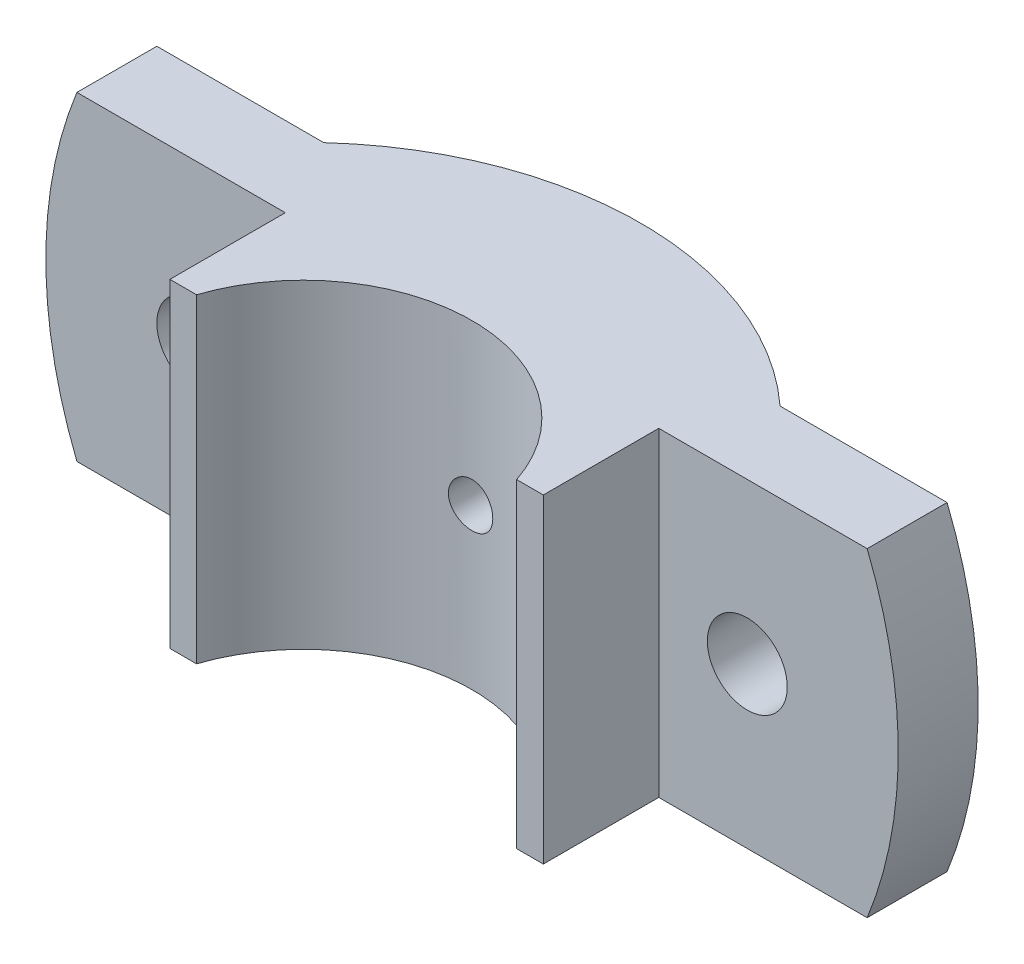
ISO-10303-21;
HEADER;
FILE_DESCRIPTION(('STEP AP214'),'2;1');
FILE_NAME('part.step','',(''),(''),'','','');
FILE_SCHEMA(('AUTOMOTIVE_DESIGN { 1 0 10303 214 1 1 1 1 }'));
ENDSEC;
DATA;
#1=APPLICATION_CONTEXT('core data for automotive mechanical design processes');
#2=APPLICATION_PROTOCOL_DEFINITION('international standard','automotive_design',2000,#1);
#3=PRODUCT_CONTEXT('',#1,'mechanical');
#4=PRODUCT('Part','Part','',(#3));
#5=PRODUCT_RELATED_PRODUCT_CATEGORY('part','',(#4));
#6=PRODUCT_DEFINITION_FORMATION('','',#4);
#7=PRODUCT_DEFINITION_CONTEXT('part definition',#1,'design');
#8=PRODUCT_DEFINITION('design','',#6,#7);
#9=PRODUCT_DEFINITION_SHAPE('','',#8);
#10=(LENGTH_UNIT() NAMED_UNIT(*) SI_UNIT(.MILLI.,.METRE.));
#11=(NAMED_UNIT(*) PLANE_ANGLE_UNIT() SI_UNIT($,.RADIAN.));
#12=(NAMED_UNIT(*) SI_UNIT($,.STERADIAN.) SOLID_ANGLE_UNIT());
#13=UNCERTAINTY_MEASURE_WITH_UNIT(LENGTH_MEASURE(1.E-05),#10,'distance_accuracy_value','');
#14=(GEOMETRIC_REPRESENTATION_CONTEXT(3) GLOBAL_UNCERTAINTY_ASSIGNED_CONTEXT((#13)) GLOBAL_UNIT_ASSIGNED_CONTEXT((#10,
#11,#12)) REPRESENTATION_CONTEXT('',''));
#15=CARTESIAN_POINT('',(0.,0.,0.));
#16=DIRECTION('',(0.,0.,1.));
#17=DIRECTION('',(1.,0.,0.));
#18=AXIS2_PLACEMENT_3D('',#15,#16,#17);
#19=CARTESIAN_POINT('',(-25.6904651573303,18.,-28.));
#20=DIRECTION('',(0.,0.,1.));
#21=DIRECTION('',(1.,0.,0.));
#22=AXIS2_PLACEMENT_3D('',#19,#20,#21);
#23=PLANE('',#22);
#24=CARTESIAN_POINT('',(0.,0.,-28.));
#25=DIRECTION('',(0.,0.,-1.));
#26=DIRECTION('',(1.,0.,0.));
#27=AXIS2_PLACEMENT_3D('',#24,#25,#26);
#28=CIRCLE('',#27,48.);
#29=CARTESIAN_POINT('',(-44.497190922574,-18.,-28.));
#30=VERTEX_POINT('',#29);
#31=CARTESIAN_POINT('',(-44.497190922574,18.,-28.));
#32=VERTEX_POINT('',#31);
#33=EDGE_CURVE('E428',#30,#32,#28,.T.);
#34=ORIENTED_EDGE('',*,*,#33,.T.);
#35=DIRECTION('',(-1.,0.,0.));
#36=VECTOR('',#35,1.);
#37=CARTESIAN_POINT('',(-25.6904651573303,18.,-28.));
#38=LINE('',#37,#36);
#39=CARTESIAN_POINT('',(-25.6904651573303,18.,-28.));
#40=VERTEX_POINT('',#39);
#41=EDGE_CURVE('E156',#40,#32,#38,.T.);
#42=ORIENTED_EDGE('',*,*,#41,.F.);
#43=DIRECTION('',(0.,-1.,0.));
#44=VECTOR('',#43,1.);
#45=CARTESIAN_POINT('',(-25.6904651573303,18.,-28.));
#46=LINE('',#45,#44);
#47=CARTESIAN_POINT('',(-25.6904651573303,6.63768331230678,-28.));
#48=VERTEX_POINT('',#47);
#49=EDGE_CURVE('E147',#40,#48,#46,.T.);
#50=ORIENTED_EDGE('',*,*,#49,.T.);
#51=CARTESIAN_POINT('',(-31.,0.,-28.));
#52=DIRECTION('',(0.,0.,1.));
#53=DIRECTION('',(-1.,0.,0.));
#54=AXIS2_PLACEMENT_3D('',#51,#52,#53);
#55=CIRCLE('',#54,8.5);
#56=CARTESIAN_POINT('',(-25.6904651573303,-6.63768331230678,-28.));
#57=VERTEX_POINT('',#56);
#58=EDGE_CURVE('E53',#57,#48,#55,.T.);
#59=ORIENTED_EDGE('',*,*,#58,.F.);
#60=CARTESIAN_POINT('',(-25.6904651573303,-18.,-28.));
#61=VERTEX_POINT('',#60);
#62=EDGE_CURVE('E150',#57,#61,#46,.T.);
#63=ORIENTED_EDGE('',*,*,#62,.T.);
#64=DIRECTION('',(-1.,0.,0.));
#65=VECTOR('',#64,1.);
#66=CARTESIAN_POINT('',(-25.6904651573303,-18.,-28.));
#67=LINE('',#66,#65);
#68=EDGE_CURVE('E476',#61,#30,#67,.T.);
#69=ORIENTED_EDGE('',*,*,#68,.T.);
#70=EDGE_LOOP('',(#34,#42,#50,#59,#63,#69));
#71=FACE_BOUND('',#70,.T.);
#72=CARTESIAN_POINT('',(-31.,0.,-28.));
#73=DIRECTION('',(0.,0.,1.));
#74=DIRECTION('',(1.,0.,0.));
#75=AXIS2_PLACEMENT_3D('',#72,#73,#74);
#76=CIRCLE('',#75,4.5);
#77=CARTESIAN_POINT('',(-26.5,0.,-28.));
#78=VERTEX_POINT('',#77);
#79=EDGE_CURVE('E141',#78,#78,#76,.T.);
#80=ORIENTED_EDGE('',*,*,#79,.T.);
#81=EDGE_LOOP('',(#80));
#82=FACE_BOUND('',#81,.T.);
#83=ADVANCED_FACE('F33',(#71,#82),#23,.F.);
#84=CARTESIAN_POINT('',(-50.,18.,-19.));
#85=DIRECTION('',(0.,0.,-1.));
#86=DIRECTION('',(-1.,0.,0.));
#87=AXIS2_PLACEMENT_3D('',#84,#85,#86);
#88=PLANE('',#87);
#89=CARTESIAN_POINT('',(0.,0.,-19.));
#90=DIRECTION('',(0.,0.,-1.));
#91=DIRECTION('',(-1.,0.,0.));
#92=AXIS2_PLACEMENT_3D('',#89,#90,#91);
#93=CIRCLE('',#92,48.);
#94=CARTESIAN_POINT('',(-44.497190922574,-18.,-19.));
#95=VERTEX_POINT('',#94);
#96=CARTESIAN_POINT('',(-44.497190922574,18.,-19.));
#97=VERTEX_POINT('',#96);
#98=EDGE_CURVE('E432',#95,#97,#93,.T.);
#99=ORIENTED_EDGE('',*,*,#98,.F.);
#100=DIRECTION('',(1.,0.,0.));
#101=VECTOR('',#100,1.);
#102=CARTESIAN_POINT('',(-50.,-18.,-19.));
#103=LINE('',#102,#101);
#104=CARTESIAN_POINT('',(-21.0277563773199,-18.,-19.));
#105=VERTEX_POINT('',#104);
#106=EDGE_CURVE('E479',#95,#105,#103,.T.);
#107=ORIENTED_EDGE('',*,*,#106,.T.);
#108=DIRECTION('',(0.,-1.,0.));
#109=VECTOR('',#108,1.);
#110=CARTESIAN_POINT('',(-21.0277563773199,18.,-19.));
#111=LINE('',#110,#109);
#112=CARTESIAN_POINT('',(-21.0277563773199,18.,-19.));
#113=VERTEX_POINT('',#112);
#114=EDGE_CURVE('E161',#113,#105,#111,.T.);
#115=ORIENTED_EDGE('',*,*,#114,.F.);
#116=DIRECTION('',(1.,0.,0.));
#117=VECTOR('',#116,1.);
#118=CARTESIAN_POINT('',(-50.,18.,-19.));
#119=LINE('',#118,#117);
#120=EDGE_CURVE('E455',#97,#113,#119,.T.);
#121=ORIENTED_EDGE('',*,*,#120,.F.);
#122=EDGE_LOOP('',(#99,#107,#115,#121));
#123=FACE_BOUND('',#122,.T.);
#124=CARTESIAN_POINT('',(-31.,0.,-19.));
#125=DIRECTION('',(0.,0.,-1.));
#126=DIRECTION('',(-1.,0.,0.));
#127=AXIS2_PLACEMENT_3D('',#124,#125,#126);
#128=CIRCLE('',#127,4.5);
#129=CARTESIAN_POINT('',(-35.5,0.,-19.));
#130=VERTEX_POINT('',#129);
#131=EDGE_CURVE('E180',#130,#130,#128,.F.);
#132=ORIENTED_EDGE('',*,*,#131,.F.);
#133=EDGE_LOOP('',(#132));
#134=FACE_BOUND('',#133,.T.);
#135=ADVANCED_FACE('F229',(#123,#134),#88,.F.);
#136=CARTESIAN_POINT('',(0.,18.,0.));
#137=DIRECTION('',(0.,-1.,0.));
#138=DIRECTION('',(0.,0.,-1.));
#139=AXIS2_PLACEMENT_3D('',#136,#137,#138);
#140=CYLINDRICAL_SURFACE('',#139,38.);
#141=CARTESIAN_POINT('',(-2.99999999999999,0.,-37.8813938497516));
#142=CARTESIAN_POINT('',(-2.99999263785231,-0.168229356223722,-37.881395424836));
#143=CARTESIAN_POINT('',(-2.98580184849921,-0.336574006245494,-37.8825265582867));
#144=CARTESIAN_POINT('',(-2.92939974932901,-0.668607649957892,-37.8869289647691));
#145=CARTESIAN_POINT('',(-2.88715648723706,-0.832291112499561,-37.8902026781767));
#146=CARTESIAN_POINT('',(-2.77587681608235,-1.1501452237575,-37.8985171541647));
#147=CARTESIAN_POINT('',(-2.70685535144457,-1.30432112294824,-37.9035569309858));
#148=CARTESIAN_POINT('',(-2.54400458445207,-1.59886160168987,-37.9148344391245));
#149=CARTESIAN_POINT('',(-2.45018067379415,-1.73922917388467,-37.92107191));
#150=CARTESIAN_POINT('',(-2.24015280345187,-2.00253137226757,-37.9340582512773));
#151=CARTESIAN_POINT('',(-2.1239032815472,-2.12542960763649,-37.9408081455451));
#152=CARTESIAN_POINT('',(-1.87242010716811,-2.34999209013841,-37.9540493837728));
#153=CARTESIAN_POINT('',(-1.7371856346283,-2.45165541954577,-37.9605407165486));
#154=CARTESIAN_POINT('',(-1.45135636719248,-2.63098168610704,-37.9725429812434));
#155=CARTESIAN_POINT('',(-1.3007419119018,-2.708613379424,-37.9780526329515));
#156=CARTESIAN_POINT('',(-0.988565369760012,-2.83747282349098,-37.9874597537665));
#157=CARTESIAN_POINT('',(-0.82700345710322,-2.88870099425837,-37.9913572485189));
#158=CARTESIAN_POINT('',(-0.497878390626905,-2.96319512715381,-37.9970937704964));
#159=CARTESIAN_POINT('',(-0.330328567016737,-2.98651964678537,-37.998937107936));
#160=CARTESIAN_POINT('',(0.00631733654750822,-3.0047253592679,-38.0003722094706));
#161=CARTESIAN_POINT('',(0.17541339034767,-2.99960703233397,-37.9999640115795));
#162=CARTESIAN_POINT('',(0.509954787192964,-2.96112032248106,-37.9969456003133));
#163=CARTESIAN_POINT('',(0.67540742527791,-2.92781491240174,-37.9943402955467));
#164=CARTESIAN_POINT('',(0.998366668593192,-2.83399732705022,-37.9872264182713));
#165=CARTESIAN_POINT('',(1.1558732048081,-2.77348491551835,-37.9827178292348));
#166=CARTESIAN_POINT('',(1.45867002090717,-2.62690060373558,-37.9722962502068));
#167=CARTESIAN_POINT('',(1.6039465541759,-2.54080042217035,-37.9663817077167));
#168=CARTESIAN_POINT('',(1.87800944429183,-2.34550517866702,-37.9538131184224));
#169=CARTESIAN_POINT('',(2.00679550141832,-2.23630969705861,-37.9471590581814));
#170=CARTESIAN_POINT('',(2.24458971981856,-1.99756841972296,-37.9338380622355));
#171=CARTESIAN_POINT('',(2.35354296660022,-1.86796791907116,-37.9271711409281));
#172=CARTESIAN_POINT('',(2.54815472752467,-1.59228636571935,-37.9145941321889));
#173=CARTESIAN_POINT('',(2.63381322519709,-1.44620530136698,-37.9086840452923));
#174=CARTESIAN_POINT('',(2.77940144234371,-1.14167162060739,-37.8982886351211));
#175=CARTESIAN_POINT('',(2.83932843779762,-0.98321769646658,-37.8938034627057));
#176=CARTESIAN_POINT('',(2.93171253141031,-0.658454052626347,-37.8867684945926));
#177=CARTESIAN_POINT('',(2.96417014717686,-0.492144481013882,-37.8842186624274));
#178=CARTESIAN_POINT('',(3.00062486955394,-0.15687062958801,-37.8813488492975));
#179=CARTESIAN_POINT('',(3.00469849779479,0.0120852808075245,-37.8810228729924));
#180=CARTESIAN_POINT('',(2.98446993701008,0.348277674479457,-37.8826218486592));
#181=CARTESIAN_POINT('',(2.96016798514648,0.515514172114851,-37.884546781818));
#182=CARTESIAN_POINT('',(2.88394184726827,0.843301603254927,-37.8904252096708));
#183=CARTESIAN_POINT('',(2.83205326228916,1.00386086655318,-37.8943760896121));
#184=CARTESIAN_POINT('',(2.70216294400362,1.31399395677734,-37.9038590548662));
#185=CARTESIAN_POINT('',(2.62416083401247,1.46356762519929,-37.9093911629878));
#186=CARTESIAN_POINT('',(2.44406357833825,1.74783416137562,-37.9214277776749));
#187=CARTESIAN_POINT('',(2.34191737427746,1.88249459296493,-37.9279343341079));
#188=CARTESIAN_POINT('',(2.11650535947003,2.13278456634996,-37.9411797159946));
#189=CARTESIAN_POINT('',(1.99323922217928,2.24841381384239,-37.9479185450382));
#190=CARTESIAN_POINT('',(1.72875604909499,2.45761968980163,-37.9608869464052));
#191=CARTESIAN_POINT('',(1.58749965829181,2.55114664697588,-37.9671153515116));
#192=CARTESIAN_POINT('',(1.29124223392212,2.71315246287969,-37.9783443227055));
#193=CARTESIAN_POINT('',(1.13624132557013,2.78163154976985,-37.9833448999771));
#194=CARTESIAN_POINT('',(0.817073838218853,2.8915121915042,-37.9915493740706));
#195=CARTESIAN_POINT('',(0.652917946506941,2.93294463032733,-37.9947553195452));
#196=CARTESIAN_POINT('',(0.319953232508929,2.98765683143964,-37.999017594232));
#197=CARTESIAN_POINT('',(0.151144488421416,3.00093706657949,-38.0000739595491));
#198=CARTESIAN_POINT('',(-0.185844007724723,2.99896261174756,-37.9999181203354));
#199=CARTESIAN_POINT('',(-0.354024222061248,2.98378540562109,-37.9987120758837));
#200=CARTESIAN_POINT('',(-0.685439460070171,2.92548825985853,-37.9941791393791));
#201=CARTESIAN_POINT('',(-0.848674476485683,2.88236827921959,-37.9908522442141));
#202=CARTESIAN_POINT('',(-1.16557212517757,2.76942883565186,-37.9824510315142));
#203=CARTESIAN_POINT('',(-1.3192351758783,2.69961054075428,-37.9773767904253));
#204=CARTESIAN_POINT('',(-1.61267080850137,2.53526551305572,-37.9660490429656));
#205=CARTESIAN_POINT('',(-1.7524436427022,2.44073922912224,-37.9597955580186));
#206=CARTESIAN_POINT('',(-2.01452730784427,2.22937105364119,-37.9467913112364));
#207=CARTESIAN_POINT('',(-2.13679197870458,2.11247200370349,-37.9400393035084));
#208=CARTESIAN_POINT('',(-2.3600119308789,1.85977604977668,-37.926809547746));
#209=CARTESIAN_POINT('',(-2.46096203215627,1.72397456524185,-37.9203318666858));
#210=CARTESIAN_POINT('',(-2.63880908526894,1.43709086811672,-37.9083720300883));
#211=CARTESIAN_POINT('',(-2.71566430398236,1.28598273615028,-37.9028916086487));
#212=CARTESIAN_POINT('',(-2.84281465262269,0.973068347368229,-37.8935681492736));
#213=CARTESIAN_POINT('',(-2.89314045280836,0.811274688620423,-37.8897232215665));
#214=CARTESIAN_POINT('',(-2.9529242107747,0.540431663186952,-37.8850993601198));
#215=CARTESIAN_POINT('',(-2.97055431578336,0.433126408915519,-37.883716139462));
#216=CARTESIAN_POINT('',(-2.99409457369404,0.217230128113448,-37.8818628767795));
#217=CARTESIAN_POINT('',(-3.00000475432558,0.108639104625571,-37.8813928325941));
#218=CARTESIAN_POINT('',(-2.99999999999999,0.,-37.8813938497516));
#219=B_SPLINE_CURVE_WITH_KNOTS('',3,(#141,#142,#143,#144,#145,#146,#147,#148,#149,#150,#151,
#152,#153,#154,#155,#156,#157,#158,#159,#160,#161,#162,#163,#164,#165,#166,#167,#168,#169,#170,
#171,#172,#173,#174,#175,#176,#177,#178,#179,#180,#181,#182,#183,#184,#185,#186,#187,#188,#189,
#190,#191,#192,#193,#194,#195,#196,#197,#198,#199,#200,#201,#202,#203,#204,#205,#206,#207,#208,
#209,#210,#211,#212,#213,#214,#215,#216,#217,#218),.UNSPECIFIED.,.T.,.F.,(4,2,2,2,2,2,2,2,2,2,2,
2,2,2,2,2,2,2,2,2,2,2,2,2,2,2,2,2,2,2,2,2,2,2,2,2,2,2,4),(0.,0.504291421669989,1.00915822788302,
1.51374368152856,2.01821953559138,2.52373134073237,3.02926498845646,3.53545315301367,
4.04163326507021,4.546749253583,5.05185671399058,5.55583868228782,6.05982502713927,
6.56437049631086,7.06892513448829,7.5748562462125,8.08078771565083,8.58677273143866,
9.09274821269729,9.59735908295554,10.1019657357268,10.6059227598395,11.10988705379,
11.6149267875576,12.1199743306602,12.6261463157288,13.1323136899712,13.6379020669613,
14.1434819519092,14.6476872439429,15.1518932758423,15.6560772516295,16.1602520685946,
16.6657325841807,17.1713358046312,17.6778099691558,18.1836973153047,18.5093592531183,
18.8350204204102),.UNSPECIFIED.);
#220=CARTESIAN_POINT('',(-2.99999999999999,0.,-37.8813938497516));
#221=VERTEX_POINT('',#220);
#222=EDGE_CURVE('E11',#221,#221,#219,.T.);
#223=ORIENTED_EDGE('',*,*,#222,.T.);
#224=EDGE_LOOP('',(#223));
#225=FACE_BOUND('',#224,.T.);
#226=ORIENTED_EDGE('',*,*,#62,.F.);
#227=CARTESIAN_POINT('',(-25.6904651573303,-6.63768331230679,-28.));
#228=CARTESIAN_POINT('',(-25.5360851043424,-6.51420867249736,-28.1416681018721));
#229=CARTESIAN_POINT('',(-25.3836215551735,-6.38340380017067,-28.2791823336498));
#230=CARTESIAN_POINT('',(-25.0841053598261,-6.1068595072457,-28.5451833866574));
#231=CARTESIAN_POINT('',(-24.9370580895264,-5.96110576476093,-28.6736613482156));
#232=CARTESIAN_POINT('',(-24.6491941230388,-5.653491442262,-28.9215085426633));
#233=CARTESIAN_POINT('',(-24.508431723833,-5.49151942353939,-29.0408031542341));
#234=CARTESIAN_POINT('',(-24.2363075607749,-5.15263687836669,-29.2682904084011));
#235=CARTESIAN_POINT('',(-24.1049430857226,-4.97573069263071,-29.3764862568107));
#236=CARTESIAN_POINT('',(-23.8528205053459,-4.60631493821572,-29.5815743674557));
#237=CARTESIAN_POINT('',(-23.7321338833277,-4.41371469093334,-29.6783916917415));
#238=CARTESIAN_POINT('',(-23.5043908446779,-4.01479632179465,-29.85908164754));
#239=CARTESIAN_POINT('',(-23.3973358972541,-3.8084767249227,-29.942952883943));
#240=CARTESIAN_POINT('',(-23.1992536300817,-3.38422419101504,-30.0966827286364));
#241=CARTESIAN_POINT('',(-23.1081729651955,-3.1663331999127,-30.1665880882949));
#242=CARTESIAN_POINT('',(-22.9434688496595,-2.72008092153074,-30.2920447623401));
#243=CARTESIAN_POINT('',(-22.869842066784,-2.49172164276593,-30.347598816803));
#244=CARTESIAN_POINT('',(-22.7499342032063,-2.05682098381956,-30.4375648556656));
#245=CARTESIAN_POINT('',(-22.7013462567531,-1.85128534823191,-30.4737833576563));
#246=CARTESIAN_POINT('',(-22.6194172898017,-1.43551725204115,-30.534645499234));
#247=CARTESIAN_POINT('',(-22.5860747992536,-1.2252852463389,-30.5592902548309));
#248=CARTESIAN_POINT('',(-22.5352129551669,-0.801799591498527,-30.5968164834569));
#249=CARTESIAN_POINT('',(-22.5176992505084,-0.588544891193922,-30.6096937569973));
#250=CARTESIAN_POINT('',(-22.4988301660851,-0.160939560666236,-30.6235658271181));
#251=CARTESIAN_POINT('',(-22.4974739036633,0.0534110090511308,-30.624561272785));
#252=CARTESIAN_POINT('',(-22.5103301119086,0.461997479818146,-30.6151119876343));
#253=CARTESIAN_POINT('',(-22.5231488228924,0.656303160135772,-30.6056914251709));
#254=CARTESIAN_POINT('',(-22.5619809221014,1.04286259298841,-30.5770763766543));
#255=CARTESIAN_POINT('',(-22.5879939672906,1.23511639873688,-30.5578821447042));
#256=CARTESIAN_POINT('',(-22.6528192304938,1.61613906729809,-30.5098574663833));
#257=CARTESIAN_POINT('',(-22.6916259266854,1.80490939654948,-30.4810311771979));
#258=CARTESIAN_POINT('',(-22.7814851533843,2.17779604427594,-30.4139289484325));
#259=CARTESIAN_POINT('',(-22.8325379785097,2.36191225066403,-30.3756527815061));
#260=CARTESIAN_POINT('',(-22.9463727274414,2.72495933677603,-30.2897519777021));
#261=CARTESIAN_POINT('',(-23.0091940590921,2.90387039063447,-30.2420959034169));
#262=CARTESIAN_POINT('',(-23.1456283742011,3.2548914886335,-30.1378044455698));
#263=CARTESIAN_POINT('',(-23.2192449894415,3.4269992191435,-30.0811660396201));
#264=CARTESIAN_POINT('',(-23.3763137314078,3.76349373210636,-29.9592695660632));
#265=CARTESIAN_POINT('',(-23.4597660818508,3.92788033882066,-29.8940113023904));
#266=CARTESIAN_POINT('',(-23.635527045378,4.24828704232643,-29.7552415450916));
#267=CARTESIAN_POINT('',(-23.7278387953854,4.40430414494655,-29.6817271265587));
#268=CARTESIAN_POINT('',(-23.9282386479047,4.71995510834892,-29.5204551498757));
#269=CARTESIAN_POINT('',(-24.0370002176616,4.87881602386906,-29.432022004933));
#270=CARTESIAN_POINT('',(-24.2623844714665,5.1856332961988,-29.2465042091278));
#271=CARTESIAN_POINT('',(-24.379010630913,5.33358477081362,-29.1494157272481));
#272=CARTESIAN_POINT('',(-24.6187042069683,5.61815393006346,-28.9472618083659));
#273=CARTESIAN_POINT('',(-24.7417672458198,5.75477915839727,-28.8422017715012));
#274=CARTESIAN_POINT('',(-24.9931857635632,6.016738259449,-28.6246099475779));
#275=CARTESIAN_POINT('',(-25.121541230047,6.14207215863705,-28.5120781780363));
#276=CARTESIAN_POINT('',(-25.3239635142993,6.32788833390874,-28.3320696328102));
#277=CARTESIAN_POINT('',(-25.3966039536003,6.39227987552885,-28.2669811541268));
#278=CARTESIAN_POINT('',(-25.5428336292653,6.51755974656749,-28.1349133065772));
#279=CARTESIAN_POINT('',(-25.6164208573993,6.57845434819234,-28.0679376662269));
#280=CARTESIAN_POINT('',(-25.6904651573302,6.63768331230704,-28.0000000000002));
#281=B_SPLINE_CURVE_WITH_KNOTS('',3,(#227,#228,#229,#230,#231,#232,#233,#234,#235,#236,#237,
#238,#239,#240,#241,#242,#243,#244,#245,#246,#247,#248,#249,#250,#251,#252,#253,#254,#255,#256,
#257,#258,#259,#260,#261,#262,#263,#264,#265,#266,#267,#268,#269,#270,#271,#272,#273,#274,#275,
#276,#277,#278,#279,#280),.UNSPECIFIED.,.F.,.F.,(4,2,2,2,2,2,2,2,2,2,2,2,2,2,2,2,2,2,2,2,2,2,2,
2,2,2,4),(0.,0.729592400834075,1.45989044138352,2.19560470883999,2.93110586753775,
3.67120763552798,4.41138910352643,5.14904966030397,5.8865692722368,6.52855006409985,
7.17046893961489,7.8126168088522,8.45472959834446,9.03890309081732,9.62306139629814,
10.2069679046447,10.7908884620571,11.3768004587137,11.9629100238154,12.549032922753,
13.1353641263273,13.7703169673958,14.4055522594533,15.040361004022,15.6751682603777,
16.0257258218313,16.3756336015193),.UNSPECIFIED.);
#282=EDGE_CURVE('E46',#57,#48,#281,.T.);
#283=ORIENTED_EDGE('',*,*,#282,.T.);
#284=ORIENTED_EDGE('',*,*,#49,.F.);
#285=CARTESIAN_POINT('',(0.,18.,0.));
#286=DIRECTION('',(0.,1.,0.));
#287=DIRECTION('',(0.,0.,1.));
#288=AXIS2_PLACEMENT_3D('',#285,#286,#287);
#289=CIRCLE('',#288,38.);
#290=CARTESIAN_POINT('',(25.6904651573303,18.,-28.));
#291=VERTEX_POINT('',#290);
#292=EDGE_CURVE('E452',#291,#40,#289,.T.);
#293=ORIENTED_EDGE('',*,*,#292,.F.);
#294=DIRECTION('',(0.,-1.,0.));
#295=VECTOR('',#294,1.);
#296=CARTESIAN_POINT('',(25.6904651573303,18.,-28.));
#297=LINE('',#296,#295);
#298=CARTESIAN_POINT('',(25.6904651573303,6.63768331230678,-28.));
#299=VERTEX_POINT('',#298);
#300=EDGE_CURVE('E159',#291,#299,#297,.T.);
#301=ORIENTED_EDGE('',*,*,#300,.T.);
#302=CARTESIAN_POINT('',(25.6904651573303,-6.63768331230679,-28.));
#303=CARTESIAN_POINT('',(25.5360851043424,-6.51420867249736,-28.1416681018721));
#304=CARTESIAN_POINT('',(25.3836215551735,-6.38340380017067,-28.2791823336498));
#305=CARTESIAN_POINT('',(25.0841053598261,-6.1068595072457,-28.5451833866574));
#306=CARTESIAN_POINT('',(24.9370580895264,-5.96110576476093,-28.6736613482156));
#307=CARTESIAN_POINT('',(24.6491941230388,-5.653491442262,-28.9215085426633));
#308=CARTESIAN_POINT('',(24.508431723833,-5.49151942353939,-29.0408031542341));
#309=CARTESIAN_POINT('',(24.2363075607749,-5.15263687836669,-29.2682904084011));
#310=CARTESIAN_POINT('',(24.1049430857226,-4.97573069263071,-29.3764862568107));
#311=CARTESIAN_POINT('',(23.8528205053459,-4.60631493821571,-29.5815743674557));
#312=CARTESIAN_POINT('',(23.7321338833277,-4.41371469093334,-29.6783916917415));
#313=CARTESIAN_POINT('',(23.5043908446779,-4.01479632179464,-29.85908164754));
#314=CARTESIAN_POINT('',(23.3973358972541,-3.80847672492269,-29.942952883943));
#315=CARTESIAN_POINT('',(23.1992536300817,-3.38422419101504,-30.0966827286364));
#316=CARTESIAN_POINT('',(23.1081729651955,-3.1663331999127,-30.1665880882949));
#317=CARTESIAN_POINT('',(22.9434688496595,-2.72008092153074,-30.2920447623401));
#318=CARTESIAN_POINT('',(22.869842066784,-2.49172164276593,-30.347598816803));
#319=CARTESIAN_POINT('',(22.7499342032063,-2.05682098381956,-30.4375648556656));
#320=CARTESIAN_POINT('',(22.7013462567531,-1.85128534823191,-30.4737833576563));
#321=CARTESIAN_POINT('',(22.6194172898017,-1.43551725204115,-30.534645499234));
#322=CARTESIAN_POINT('',(22.5860747992536,-1.2252852463389,-30.5592902548309));
#323=CARTESIAN_POINT('',(22.5352129551669,-0.801799591498525,-30.5968164834569));
#324=CARTESIAN_POINT('',(22.5176992505084,-0.588544891193919,-30.6096937569973));
#325=CARTESIAN_POINT('',(22.4988301660851,-0.160939560666232,-30.6235658271181));
#326=CARTESIAN_POINT('',(22.4974739036633,0.0534110090511353,-30.624561272785));
#327=CARTESIAN_POINT('',(22.5103301119086,0.461997479818152,-30.6151119876343));
#328=CARTESIAN_POINT('',(22.5231488228924,0.656303160135778,-30.6056914251709));
#329=CARTESIAN_POINT('',(22.5619809221014,1.04286259298841,-30.5770763766543));
#330=CARTESIAN_POINT('',(22.5879939672906,1.23511639873689,-30.5578821447042));
#331=CARTESIAN_POINT('',(22.6528192304938,1.6161390672981,-30.5098574663833));
#332=CARTESIAN_POINT('',(22.6916259266854,1.80490939654949,-30.4810311771979));
#333=CARTESIAN_POINT('',(22.7814851533843,2.17779604427594,-30.4139289484325));
#334=CARTESIAN_POINT('',(22.8325379785097,2.36191225066403,-30.3756527815061));
#335=CARTESIAN_POINT('',(22.9463727274414,2.72495933677603,-30.2897519777021));
#336=CARTESIAN_POINT('',(23.0091940590921,2.90387039063447,-30.2420959034169));
#337=CARTESIAN_POINT('',(23.1456283742011,3.2548914886335,-30.1378044455698));
#338=CARTESIAN_POINT('',(23.2192449894415,3.4269992191435,-30.0811660396201));
#339=CARTESIAN_POINT('',(23.3763137314078,3.76349373210637,-29.9592695660632));
#340=CARTESIAN_POINT('',(23.4597660818508,3.92788033882066,-29.8940113023904));
#341=CARTESIAN_POINT('',(23.635527045378,4.24828704232643,-29.7552415450916));
#342=CARTESIAN_POINT('',(23.7278387953854,4.40430414494656,-29.6817271265587));
#343=CARTESIAN_POINT('',(23.9282386479047,4.71995510834892,-29.5204551498757));
#344=CARTESIAN_POINT('',(24.0370002176616,4.87881602386906,-29.432022004933));
#345=CARTESIAN_POINT('',(24.2623844714665,5.18563329619881,-29.2465042091278));
#346=CARTESIAN_POINT('',(24.379010630913,5.33358477081363,-29.149415727248));
#347=CARTESIAN_POINT('',(24.6187042069683,5.61815393006347,-28.9472618083659));
#348=CARTESIAN_POINT('',(24.7417672458198,5.75477915839728,-28.8422017715012));
#349=CARTESIAN_POINT('',(24.9931857635632,6.01673825944901,-28.6246099475779));
#350=CARTESIAN_POINT('',(25.121541230047,6.14207215863705,-28.5120781780363));
#351=CARTESIAN_POINT('',(25.3239635142993,6.32788833390875,-28.3320696328102));
#352=CARTESIAN_POINT('',(25.3966039536004,6.39227987552886,-28.2669811541268));
#353=CARTESIAN_POINT('',(25.5428336292653,6.5175597465675,-28.1349133065772));
#354=CARTESIAN_POINT('',(25.6164208573994,6.57845434819235,-28.0679376662269));
#355=CARTESIAN_POINT('',(25.6904651573302,6.63768331230705,-28.0000000000002));
#356=B_SPLINE_CURVE_WITH_KNOTS('',3,(#302,#303,#304,#305,#306,#307,#308,#309,#310,#311,#312,
#313,#314,#315,#316,#317,#318,#319,#320,#321,#322,#323,#324,#325,#326,#327,#328,#329,#330,#331,
#332,#333,#334,#335,#336,#337,#338,#339,#340,#341,#342,#343,#344,#345,#346,#347,#348,#349,#350,
#351,#352,#353,#354,#355),.UNSPECIFIED.,.F.,.F.,(4,2,2,2,2,2,2,2,2,2,2,2,2,2,2,2,2,2,2,2,2,2,2,
2,2,2,4),(0.,0.729592400834072,1.45989044138351,2.19560470883998,2.93110586753775,
3.67120763552798,4.41138910352643,5.14904966030396,5.88656927223679,6.52855006409984,
7.17046893961488,7.8126168088522,8.45472959834445,9.03890309081732,9.62306139629814,
10.2069679046447,10.7908884620571,11.3768004587137,11.9629100238154,12.549032922753,
13.1353641263273,13.7703169673958,14.4055522594533,15.040361004022,15.6751682603777,
16.0257258218313,16.3756336015193),.UNSPECIFIED.);
#357=CARTESIAN_POINT('',(25.6904651573303,-6.63768331230678,-28.));
#358=VERTEX_POINT('',#357);
#359=EDGE_CURVE('E151',#358,#299,#356,.T.);
#360=ORIENTED_EDGE('',*,*,#359,.F.);
#361=CARTESIAN_POINT('',(25.6904651573303,-18.,-28.));
#362=VERTEX_POINT('',#361);
#363=EDGE_CURVE('E157',#358,#362,#297,.T.);
#364=ORIENTED_EDGE('',*,*,#363,.T.);
#365=CARTESIAN_POINT('',(0.,-18.,0.));
#366=DIRECTION('',(0.,1.,0.));
#367=DIRECTION('',(0.,0.,1.));
#368=AXIS2_PLACEMENT_3D('',#365,#366,#367);
#369=CIRCLE('',#368,38.);
#370=EDGE_CURVE('E474',#362,#61,#369,.T.);
#371=ORIENTED_EDGE('',*,*,#370,.T.);
#372=EDGE_LOOP('',(#226,#283,#284,#293,#301,#360,#364,#371));
#373=FACE_BOUND('',#372,.T.);
#374=ADVANCED_FACE('F145',(#225,#373),#140,.T.);
#375=CARTESIAN_POINT('',(0.,18.,0.));
#376=DIRECTION('',(0.,1.,0.));
#377=DIRECTION('',(0.,0.,1.));
#378=AXIS2_PLACEMENT_3D('',#375,#376,#377);
#379=PLANE('',#378);
#380=ORIENTED_EDGE('',*,*,#41,.T.);
#381=DIRECTION('',(0.,0.,-1.));
#382=VECTOR('',#381,1.);
#383=CARTESIAN_POINT('',(-44.497190922574,18.,8.));
#384=LINE('',#383,#382);
#385=EDGE_CURVE('E430',#97,#32,#384,.T.);
#386=ORIENTED_EDGE('',*,*,#385,.F.);
#387=ORIENTED_EDGE('',*,*,#120,.T.);
#388=DIRECTION('',(0.,0.,1.));
#389=VECTOR('',#388,1.);
#390=CARTESIAN_POINT('',(-21.0277563773199,18.,-19.));
#391=LINE('',#390,#389);
#392=CARTESIAN_POINT('',(-21.0277563773199,18.,-6.));
#393=VERTEX_POINT('',#392);
#394=EDGE_CURVE('E457',#113,#393,#391,.T.);
#395=ORIENTED_EDGE('',*,*,#394,.T.);
#396=DIRECTION('',(1.,0.,0.));
#397=VECTOR('',#396,1.);
#398=CARTESIAN_POINT('',(-21.0277563773199,18.,-6.));
#399=LINE('',#398,#397);
#400=CARTESIAN_POINT('',(-18.0277563773199,18.,-6.));
#401=VERTEX_POINT('',#400);
#402=EDGE_CURVE('E459',#393,#401,#399,.T.);
#403=ORIENTED_EDGE('',*,*,#402,.T.);
#404=CARTESIAN_POINT('',(0.,18.,0.));
#405=DIRECTION('',(0.,-1.,0.));
#406=DIRECTION('',(0.,0.,1.));
#407=AXIS2_PLACEMENT_3D('',#404,#405,#406);
#408=CIRCLE('',#407,19.);
#409=CARTESIAN_POINT('',(18.0277563773199,18.,-6.));
#410=VERTEX_POINT('',#409);
#411=EDGE_CURVE('E461',#401,#410,#408,.T.);
#412=ORIENTED_EDGE('',*,*,#411,.T.);
#413=DIRECTION('',(1.,0.,0.));
#414=VECTOR('',#413,1.);
#415=CARTESIAN_POINT('',(21.0277563773199,18.,-6.));
#416=LINE('',#415,#414);
#417=CARTESIAN_POINT('',(21.0277563773199,18.,-6.));
#418=VERTEX_POINT('',#417);
#419=EDGE_CURVE('E463',#410,#418,#416,.T.);
#420=ORIENTED_EDGE('',*,*,#419,.T.);
#421=DIRECTION('',(0.,0.,-1.));
#422=VECTOR('',#421,1.);
#423=CARTESIAN_POINT('',(21.0277563773199,18.,-19.));
#424=LINE('',#423,#422);
#425=CARTESIAN_POINT('',(21.0277563773199,18.,-19.));
#426=VERTEX_POINT('',#425);
#427=EDGE_CURVE('E443',#418,#426,#424,.T.);
#428=ORIENTED_EDGE('',*,*,#427,.T.);
#429=DIRECTION('',(1.,0.,0.));
#430=VECTOR('',#429,1.);
#431=CARTESIAN_POINT('',(50.,18.,-19.));
#432=LINE('',#431,#430);
#433=CARTESIAN_POINT('',(44.497190922574,18.,-19.));
#434=VERTEX_POINT('',#433);
#435=EDGE_CURVE('E446',#426,#434,#432,.T.);
#436=ORIENTED_EDGE('',*,*,#435,.T.);
#437=DIRECTION('',(0.,0.,-1.));
#438=VECTOR('',#437,1.);
#439=CARTESIAN_POINT('',(44.497190922574,18.,8.));
#440=LINE('',#439,#438);
#441=CARTESIAN_POINT('',(44.497190922574,18.,-28.));
#442=VERTEX_POINT('',#441);
#443=EDGE_CURVE('E436',#434,#442,#440,.T.);
#444=ORIENTED_EDGE('',*,*,#443,.T.);
#445=DIRECTION('',(-1.,0.,0.));
#446=VECTOR('',#445,1.);
#447=CARTESIAN_POINT('',(25.6904651573303,18.,-28.));
#448=LINE('',#447,#446);
#449=EDGE_CURVE('E450',#442,#291,#448,.T.);
#450=ORIENTED_EDGE('',*,*,#449,.T.);
#451=ORIENTED_EDGE('',*,*,#292,.T.);
#452=EDGE_LOOP('',(#380,#386,#387,#395,#403,#412,#420,#428,#436,#444,#450,#451));
#453=FACE_BOUND('',#452,.T.);
#454=ADVANCED_FACE('F205',(#453),#379,.T.);
#455=CARTESIAN_POINT('',(0.,-18.,0.));
#456=DIRECTION('',(0.,1.,0.));
#457=DIRECTION('',(0.,0.,1.));
#458=AXIS2_PLACEMENT_3D('',#455,#456,#457);
#459=PLANE('',#458);
#460=DIRECTION('',(0.,0.,-1.));
#461=VECTOR('',#460,1.);
#462=CARTESIAN_POINT('',(-44.497190922574,-18.,8.));
#463=LINE('',#462,#461);
#464=EDGE_CURVE('E172',#30,#95,#463,.F.);
#465=ORIENTED_EDGE('',*,*,#464,.F.);
#466=ORIENTED_EDGE('',*,*,#68,.F.);
#467=ORIENTED_EDGE('',*,*,#370,.F.);
#468=DIRECTION('',(-1.,0.,0.));
#469=VECTOR('',#468,1.);
#470=CARTESIAN_POINT('',(25.6904651573303,-18.,-28.));
#471=LINE('',#470,#469);
#472=CARTESIAN_POINT('',(44.497190922574,-18.,-28.));
#473=VERTEX_POINT('',#472);
#474=EDGE_CURVE('E471',#473,#362,#471,.T.);
#475=ORIENTED_EDGE('',*,*,#474,.F.);
#476=DIRECTION('',(0.,0.,-1.));
#477=VECTOR('',#476,1.);
#478=CARTESIAN_POINT('',(44.497190922574,-18.,8.));
#479=LINE('',#478,#477);
#480=CARTESIAN_POINT('',(44.497190922574,-18.,-19.));
#481=VERTEX_POINT('',#480);
#482=EDGE_CURVE('E169',#473,#481,#479,.F.);
#483=ORIENTED_EDGE('',*,*,#482,.T.);
#484=DIRECTION('',(1.,0.,0.));
#485=VECTOR('',#484,1.);
#486=CARTESIAN_POINT('',(50.,-18.,-19.));
#487=LINE('',#486,#485);
#488=CARTESIAN_POINT('',(21.0277563773199,-18.,-19.));
#489=VERTEX_POINT('',#488);
#490=EDGE_CURVE('E468',#489,#481,#487,.T.);
#491=ORIENTED_EDGE('',*,*,#490,.F.);
#492=DIRECTION('',(0.,0.,-1.));
#493=VECTOR('',#492,1.);
#494=CARTESIAN_POINT('',(21.0277563773199,-18.,-19.));
#495=LINE('',#494,#493);
#496=CARTESIAN_POINT('',(21.0277563773199,-18.,-6.));
#497=VERTEX_POINT('',#496);
#498=EDGE_CURVE('E442',#497,#489,#495,.T.);
#499=ORIENTED_EDGE('',*,*,#498,.F.);
#500=DIRECTION('',(1.,0.,0.));
#501=VECTOR('',#500,1.);
#502=CARTESIAN_POINT('',(21.0277563773199,-18.,-6.));
#503=LINE('',#502,#501);
#504=CARTESIAN_POINT('',(18.0277563773199,-18.,-6.));
#505=VERTEX_POINT('',#504);
#506=EDGE_CURVE('E447',#505,#497,#503,.T.);
#507=ORIENTED_EDGE('',*,*,#506,.F.);
#508=CARTESIAN_POINT('',(0.,-18.,0.));
#509=DIRECTION('',(0.,-1.,0.));
#510=DIRECTION('',(0.,0.,1.));
#511=AXIS2_PLACEMENT_3D('',#508,#509,#510);
#512=CIRCLE('',#511,19.);
#513=CARTESIAN_POINT('',(-18.0277563773199,-18.,-6.));
#514=VERTEX_POINT('',#513);
#515=EDGE_CURVE('E485',#514,#505,#512,.T.);
#516=ORIENTED_EDGE('',*,*,#515,.F.);
#517=DIRECTION('',(1.,0.,0.));
#518=VECTOR('',#517,1.);
#519=CARTESIAN_POINT('',(-21.0277563773199,-18.,-6.));
#520=LINE('',#519,#518);
#521=CARTESIAN_POINT('',(-21.0277563773199,-18.,-6.));
#522=VERTEX_POINT('',#521);
#523=EDGE_CURVE('E483',#522,#514,#520,.T.);
#524=ORIENTED_EDGE('',*,*,#523,.F.);
#525=DIRECTION('',(0.,0.,1.));
#526=VECTOR('',#525,1.);
#527=CARTESIAN_POINT('',(-21.0277563773199,-18.,-19.));
#528=LINE('',#527,#526);
#529=EDGE_CURVE('E481',#105,#522,#528,.T.);
#530=ORIENTED_EDGE('',*,*,#529,.F.);
#531=ORIENTED_EDGE('',*,*,#106,.F.);
#532=EDGE_LOOP('',(#465,#466,#467,#475,#483,#491,#499,#507,#516,#524,#530,#531));
#533=FACE_BOUND('',#532,.T.);
#534=ADVANCED_FACE('F208',(#533),#459,.F.);
#535=CARTESIAN_POINT('',(21.0277563773199,18.,-19.));
#536=DIRECTION('',(-1.,0.,0.));
#537=DIRECTION('',(0.,0.,1.));
#538=AXIS2_PLACEMENT_3D('',#535,#536,#537);
#539=PLANE('',#538);
#540=ORIENTED_EDGE('',*,*,#498,.T.);
#541=DIRECTION('',(0.,-1.,0.));
#542=VECTOR('',#541,1.);
#543=CARTESIAN_POINT('',(21.0277563773199,18.,-19.));
#544=LINE('',#543,#542);
#545=EDGE_CURVE('E166',#426,#489,#544,.T.);
#546=ORIENTED_EDGE('',*,*,#545,.F.);
#547=ORIENTED_EDGE('',*,*,#427,.F.);
#548=DIRECTION('',(0.,-1.,0.));
#549=VECTOR('',#548,1.);
#550=CARTESIAN_POINT('',(21.0277563773199,18.,-6.));
#551=LINE('',#550,#549);
#552=EDGE_CURVE('E465',#418,#497,#551,.T.);
#553=ORIENTED_EDGE('',*,*,#552,.T.);
#554=EDGE_LOOP('',(#540,#546,#547,#553));
#555=FACE_BOUND('',#554,.T.);
#556=ADVANCED_FACE('F35',(#555),#539,.F.);
#557=CARTESIAN_POINT('',(50.,18.,-19.));
#558=DIRECTION('',(0.,0.,-1.));
#559=DIRECTION('',(-1.,0.,0.));
#560=AXIS2_PLACEMENT_3D('',#557,#558,#559);
#561=PLANE('',#560);
#562=CARTESIAN_POINT('',(31.,0.,-19.));
#563=DIRECTION('',(0.,0.,-1.));
#564=DIRECTION('',(-1.,0.,0.));
#565=AXIS2_PLACEMENT_3D('',#562,#563,#564);
#566=CIRCLE('',#565,4.5);
#567=CARTESIAN_POINT('',(26.5,0.,-19.));
#568=VERTEX_POINT('',#567);
#569=EDGE_CURVE('E425',#568,#568,#566,.T.);
#570=ORIENTED_EDGE('',*,*,#569,.T.);
#571=EDGE_LOOP('',(#570));
#572=FACE_BOUND('',#571,.T.);
#573=ORIENTED_EDGE('',*,*,#490,.T.);
#574=CARTESIAN_POINT('',(0.,0.,-19.));
#575=DIRECTION('',(0.,0.,-1.));
#576=DIRECTION('',(-1.,0.,0.));
#577=AXIS2_PLACEMENT_3D('',#574,#575,#576);
#578=CIRCLE('',#577,48.);
#579=EDGE_CURVE('E439',#481,#434,#578,.F.);
#580=ORIENTED_EDGE('',*,*,#579,.T.);
#581=ORIENTED_EDGE('',*,*,#435,.F.);
#582=ORIENTED_EDGE('',*,*,#545,.T.);
#583=EDGE_LOOP('',(#573,#580,#581,#582));
#584=FACE_BOUND('',#583,.T.);
#585=ADVANCED_FACE('F265',(#572,#584),#561,.F.);
#586=CARTESIAN_POINT('',(25.6904651573303,18.,-28.));
#587=DIRECTION('',(0.,0.,1.));
#588=DIRECTION('',(1.,0.,0.));
#589=AXIS2_PLACEMENT_3D('',#586,#587,#588);
#590=PLANE('',#589);
#591=CARTESIAN_POINT('',(31.,0.,-28.));
#592=DIRECTION('',(0.,0.,-1.));
#593=DIRECTION('',(-1.,0.,0.));
#594=AXIS2_PLACEMENT_3D('',#591,#592,#593);
#595=CIRCLE('',#594,4.5);
#596=CARTESIAN_POINT('',(26.5,0.,-28.));
#597=VERTEX_POINT('',#596);
#598=EDGE_CURVE('E422',#597,#597,#595,.T.);
#599=ORIENTED_EDGE('',*,*,#598,.F.);
#600=EDGE_LOOP('',(#599));
#601=FACE_BOUND('',#600,.T.);
#602=ORIENTED_EDGE('',*,*,#449,.F.);
#603=CARTESIAN_POINT('',(0.,0.,-28.));
#604=DIRECTION('',(0.,0.,1.));
#605=DIRECTION('',(-1.,0.,0.));
#606=AXIS2_PLACEMENT_3D('',#603,#604,#605);
#607=CIRCLE('',#606,48.);
#608=EDGE_CURVE('E434',#473,#442,#607,.T.);
#609=ORIENTED_EDGE('',*,*,#608,.F.);
#610=ORIENTED_EDGE('',*,*,#474,.T.);
#611=ORIENTED_EDGE('',*,*,#363,.F.);
#612=CARTESIAN_POINT('',(31.,0.,-28.));
#613=DIRECTION('',(0.,0.,-1.));
#614=DIRECTION('',(1.,0.,0.));
#615=AXIS2_PLACEMENT_3D('',#612,#613,#614);
#616=CIRCLE('',#615,8.5);
#617=EDGE_CURVE('E61',#358,#299,#616,.T.);
#618=ORIENTED_EDGE('',*,*,#617,.T.);
#619=ORIENTED_EDGE('',*,*,#300,.F.);
#620=EDGE_LOOP('',(#602,#609,#610,#611,#618,#619));
#621=FACE_BOUND('',#620,.T.);
#622=ADVANCED_FACE('F227',(#601,#621),#590,.F.);
#623=CARTESIAN_POINT('',(-21.0277563773199,18.,-19.));
#624=DIRECTION('',(1.,0.,0.));
#625=DIRECTION('',(0.,0.,-1.));
#626=AXIS2_PLACEMENT_3D('',#623,#624,#625);
#627=PLANE('',#626);
#628=ORIENTED_EDGE('',*,*,#529,.T.);
#629=DIRECTION('',(0.,-1.,0.));
#630=VECTOR('',#629,1.);
#631=CARTESIAN_POINT('',(-21.0277563773199,18.,-6.));
#632=LINE('',#631,#630);
#633=EDGE_CURVE('E495',#393,#522,#632,.T.);
#634=ORIENTED_EDGE('',*,*,#633,.F.);
#635=ORIENTED_EDGE('',*,*,#394,.F.);
#636=ORIENTED_EDGE('',*,*,#114,.T.);
#637=EDGE_LOOP('',(#628,#634,#635,#636));
#638=FACE_BOUND('',#637,.T.);
#639=ADVANCED_FACE('F223',(#638),#627,.F.);
#640=CARTESIAN_POINT('',(-21.0277563773199,18.,-6.));
#641=DIRECTION('',(0.,0.,-1.));
#642=DIRECTION('',(-1.,0.,0.));
#643=AXIS2_PLACEMENT_3D('',#640,#641,#642);
#644=PLANE('',#643);
#645=ORIENTED_EDGE('',*,*,#523,.T.);
#646=DIRECTION('',(0.,-1.,0.));
#647=VECTOR('',#646,1.);
#648=CARTESIAN_POINT('',(-18.0277563773199,18.,-6.));
#649=LINE('',#648,#647);
#650=EDGE_CURVE('E493',#401,#514,#649,.T.);
#651=ORIENTED_EDGE('',*,*,#650,.F.);
#652=ORIENTED_EDGE('',*,*,#402,.F.);
#653=ORIENTED_EDGE('',*,*,#633,.T.);
#654=EDGE_LOOP('',(#645,#651,#652,#653));
#655=FACE_BOUND('',#654,.T.);
#656=ADVANCED_FACE('F219',(#655),#644,.F.);
#657=CARTESIAN_POINT('',(0.,18.,0.));
#658=DIRECTION('',(0.,-1.,0.));
#659=DIRECTION('',(0.,0.,-1.));
#660=AXIS2_PLACEMENT_3D('',#657,#658,#659);
#661=CYLINDRICAL_SURFACE('',#660,19.);
#662=CARTESIAN_POINT('',(-2.49999999999999,0.,-18.8348082018374));
#663=CARTESIAN_POINT('',(-2.49999409578524,0.139772410707228,-18.8348103005537));
#664=CARTESIAN_POINT('',(-2.48823862932085,0.279630654917696,-18.8363808783556));
#665=CARTESIAN_POINT('',(-2.44153211686149,0.555450449604444,-18.8424906592257));
#666=CARTESIAN_POINT('',(-2.40655722916087,0.691407844841228,-18.847032913542));
#667=CARTESIAN_POINT('',(-2.31446464350121,0.955392840298785,-18.8585628581225));
#668=CARTESIAN_POINT('',(-2.25736245608321,1.08342592246777,-18.865548835081));
#669=CARTESIAN_POINT('',(-2.12267026806168,1.32807015559524,-18.8811770275024));
#670=CARTESIAN_POINT('',(-2.0450836013815,1.44468316098251,-18.8898189733878));
#671=CARTESIAN_POINT('',(-1.87111107289513,1.66392100396941,-18.9078452303947));
#672=CARTESIAN_POINT('',(-1.77462365227276,1.7664649447672,-18.9172333815059));
#673=CARTESIAN_POINT('',(-1.56580738299606,1.95395445346304,-18.9356597775486));
#674=CARTESIAN_POINT('',(-1.45347772691953,2.03889912384395,-18.9446980046157));
#675=CARTESIAN_POINT('',(-1.21565447428568,2.1890712575453,-18.9614457365025));
#676=CARTESIAN_POINT('',(-1.09011404546435,2.25422515928236,-18.9691502393822));
#677=CARTESIAN_POINT('',(-0.829754686720083,2.36249489410533,-18.9823201413144));
#678=CARTESIAN_POINT('',(-0.694936137097197,2.40561162986091,-18.9877856320778));
#679=CARTESIAN_POINT('',(-0.420676626941271,2.46834044520401,-18.9958346390645));
#680=CARTESIAN_POINT('',(-0.281266987599394,2.48808731176756,-18.998434675905));
#681=CARTESIAN_POINT('',(-0.00109010892107242,2.50393376893561,-19.0005162894914));
#682=CARTESIAN_POINT('',(0.139677071308372,2.50003438449259,-18.9999980014017));
#683=CARTESIAN_POINT('',(0.41765549562526,2.46880664147129,-18.9959146873145));
#684=CARTESIAN_POINT('',(0.554883341583921,2.44162325419791,-18.9923685140246));
#685=CARTESIAN_POINT('',(0.822812428692207,2.36482599286765,-18.9826489891627));
#686=CARTESIAN_POINT('',(0.953513534513065,2.31521165393022,-18.9764755831415));
#687=CARTESIAN_POINT('',(1.20512535683873,2.19480811452033,-18.9621627474723));
#688=CARTESIAN_POINT('',(1.32600591164241,2.12395659803214,-18.9540175457263));
#689=CARTESIAN_POINT('',(1.55421628813348,1.96313528742037,-18.9366715492133));
#690=CARTESIAN_POINT('',(1.66154542112792,1.87316452226583,-18.9274707008429));
#691=CARTESIAN_POINT('',(1.86045869817727,1.67584774631525,-18.9089599960683));
#692=CARTESIAN_POINT('',(1.95191747053696,1.5683753315042,-18.8996498417821));
#693=CARTESIAN_POINT('',(2.11551832656892,1.33953904763814,-18.8820383954162));
#694=CARTESIAN_POINT('',(2.18766033727908,1.21817512611544,-18.8737371071471));
#695=CARTESIAN_POINT('',(2.3105893747748,0.964884545898979,-18.8590834811492));
#696=CARTESIAN_POINT('',(2.36136566187571,0.832952614660604,-18.8527321240046));
#697=CARTESIAN_POINT('',(2.4400070674317,0.562332271850075,-18.8427161416511));
#698=CARTESIAN_POINT('',(2.46787341394892,0.423644222854373,-18.8390513724318));
#699=CARTESIAN_POINT('',(2.4997364331773,0.144557770604837,-18.8348501026747));
#700=CARTESIAN_POINT('',(2.50390985775509,0.00417988267501889,-18.8342904384187));
#701=CARTESIAN_POINT('',(2.48873557934184,-0.275273112895705,-18.8363014282045));
#702=CARTESIAN_POINT('',(2.46938843336154,-0.414348251309537,-18.8388720081163));
#703=CARTESIAN_POINT('',(2.4078713017442,-0.68671384532068,-18.8468326765771));
#704=CARTESIAN_POINT('',(2.36578750914763,-0.820024106929615,-18.8522121143747));
#705=CARTESIAN_POINT('',(2.26008064221151,-1.07769659074714,-18.8651757043717));
#706=CARTESIAN_POINT('',(2.19645673422975,-1.20205846641077,-18.8727599418992));
#707=CARTESIAN_POINT('',(2.04904355294262,-1.43910187947633,-18.8893338461434));
#708=CARTESIAN_POINT('',(1.96513873634294,-1.55171099776969,-18.8983314583415));
#709=CARTESIAN_POINT('',(1.77970815022903,-1.76131206225707,-18.9166936217277));
#710=CARTESIAN_POINT('',(1.67818161958444,-1.85830333352431,-18.926058188752));
#711=CARTESIAN_POINT('',(1.45961588711243,-2.03453978862285,-18.9441705799359));
#712=CARTESIAN_POINT('',(1.34248242957225,-2.11366858191608,-18.9529141182398));
#713=CARTESIAN_POINT('',(1.09648411237258,-2.25112719879753,-18.9687346092958));
#714=CARTESIAN_POINT('',(0.967619510833919,-2.30945747987743,-18.9758115987047));
#715=CARTESIAN_POINT('',(0.7021978788571,-2.40347261332034,-18.9874826488638));
#716=CARTESIAN_POINT('',(0.56566468971764,-2.43922383380948,-18.9920839805179));
#717=CARTESIAN_POINT('',(0.288468615416631,-2.48728165155039,-18.9983155475114));
#718=CARTESIAN_POINT('',(0.147805938002302,-2.49958942615497,-18.9999459320545));
#719=CARTESIAN_POINT('',(-0.132521661638362,-2.50038732371433,-19.0000510083828));
#720=CARTESIAN_POINT('',(-0.272186098802341,-2.48905656815023,-18.9985494326839));
#721=CARTESIAN_POINT('',(-0.547606882566138,-2.44327953837194,-18.9926066364398));
#722=CARTESIAN_POINT('',(-0.683363234019728,-2.40883329286806,-18.9881654195457));
#723=CARTESIAN_POINT('',(-0.947084347124,-2.31786118504363,-18.9768400549043));
#724=CARTESIAN_POINT('',(-1.07505244642358,-2.26134485895363,-18.969956962381));
#725=CARTESIAN_POINT('',(-1.31971689824452,-2.12785549941422,-18.9545084892845));
#726=CARTESIAN_POINT('',(-1.43641305847677,-2.05088211706991,-18.94594308002));
#727=CARTESIAN_POINT('',(-1.65613473301187,-1.87800438938243,-18.9280077185042));
#728=CARTESIAN_POINT('',(-1.75905510552541,-1.78196696135376,-18.9186323881523));
#729=CARTESIAN_POINT('',(-1.94738775545751,-1.57396529634802,-18.9001761775766));
#730=CARTESIAN_POINT('',(-2.03279589210143,-1.46199730315985,-18.8910953674186));
#731=CARTESIAN_POINT('',(-2.1839968177649,-1.22475904167364,-18.8742148988462));
#732=CARTESIAN_POINT('',(-2.24970411848514,-1.09943390887032,-18.8664208881083));
#733=CARTESIAN_POINT('',(-2.35904458082509,-0.839492467959364,-18.85306260999));
#734=CARTESIAN_POINT('',(-2.40270148171341,-0.704886329967057,-18.8474959460153));
#735=CARTESIAN_POINT('',(-2.45638258319663,-0.474670862248903,-18.8405583157814));
#736=CARTESIAN_POINT('',(-2.4727152301939,-0.380506812944518,-18.8384129295943));
#737=CARTESIAN_POINT('',(-2.49452590747469,-0.19090851784083,-18.8355371620448));
#738=CARTESIAN_POINT('',(-2.50000403298954,-0.0954742831927987,-18.8348067682681));
#739=CARTESIAN_POINT('',(-2.49999999999999,0.,-18.8348082018374));
#740=B_SPLINE_CURVE_WITH_KNOTS('',3,(#662,#663,#664,#665,#666,#667,#668,#669,#670,#671,#672,
#673,#674,#675,#676,#677,#678,#679,#680,#681,#682,#683,#684,#685,#686,#687,#688,#689,#690,#691,
#692,#693,#694,#695,#696,#697,#698,#699,#700,#701,#702,#703,#704,#705,#706,#707,#708,#709,#710,
#711,#712,#713,#714,#715,#716,#717,#718,#719,#720,#721,#722,#723,#724,#725,#726,#727,#728,#729,
#730,#731,#732,#733,#734,#735,#736,#737,#738,#739),.UNSPECIFIED.,.T.,.F.,(4,2,2,2,2,2,2,2,2,2,2,
2,2,2,2,2,2,2,2,2,2,2,2,2,2,2,2,2,2,2,2,2,2,2,2,2,2,2,4),(0.,0.418968405157234,
0.838367673884207,1.25747348717214,1.67651113147086,2.09786539850394,2.5192411482254,
2.94216449298394,3.36507051288868,3.78552532472134,4.20596191196856,4.62379964025608,
5.0416460286104,5.46073070560077,5.87983667220913,6.30211603448238,6.72439699174149,
7.14688995971333,7.56936027893769,7.98867473820329,8.40797926751844,8.82570528325036,
9.24344746759815,9.6636281369549,10.0838269595902,10.5066894380017,10.9295426144014,
11.3511470138381,11.7727302393306,12.1911305153045,12.6095302716104,13.0277494418252,
13.4459757452217,13.8672313515222,14.2885864492938,14.7117443270811,15.1344456605118,
15.4206327478507,15.7068173243377),.UNSPECIFIED.);
#741=CARTESIAN_POINT('',(-2.49999999999999,0.,-18.8348082018374));
#742=VERTEX_POINT('',#741);
#743=EDGE_CURVE('E37',#742,#742,#740,.T.);
#744=ORIENTED_EDGE('',*,*,#743,.T.);
#745=EDGE_LOOP('',(#744));
#746=FACE_BOUND('',#745,.T.);
#747=ORIENTED_EDGE('',*,*,#515,.T.);
#748=DIRECTION('',(0.,-1.,0.));
#749=VECTOR('',#748,1.);
#750=CARTESIAN_POINT('',(18.0277563773199,18.,-6.));
#751=LINE('',#750,#749);
#752=EDGE_CURVE('E490',#410,#505,#751,.T.);
#753=ORIENTED_EDGE('',*,*,#752,.F.);
#754=ORIENTED_EDGE('',*,*,#411,.F.);
#755=ORIENTED_EDGE('',*,*,#650,.T.);
#756=EDGE_LOOP('',(#747,#753,#754,#755));
#757=FACE_BOUND('',#756,.T.);
#758=ADVANCED_FACE('F214',(#746,#757),#661,.F.);
#759=CARTESIAN_POINT('',(21.0277563773199,18.,-6.));
#760=DIRECTION('',(0.,0.,-1.));
#761=DIRECTION('',(-1.,0.,0.));
#762=AXIS2_PLACEMENT_3D('',#759,#760,#761);
#763=PLANE('',#762);
#764=ORIENTED_EDGE('',*,*,#506,.T.);
#765=ORIENTED_EDGE('',*,*,#552,.F.);
#766=ORIENTED_EDGE('',*,*,#419,.F.);
#767=ORIENTED_EDGE('',*,*,#752,.T.);
#768=EDGE_LOOP('',(#764,#765,#766,#767));
#769=FACE_BOUND('',#768,.T.);
#770=ADVANCED_FACE('F203',(#769),#763,.F.);
#771=CARTESIAN_POINT('',(0.,0.,7.99999999999999));
#772=DIRECTION('',(0.,0.,-1.));
#773=DIRECTION('',(-1.,0.,0.));
#774=AXIS2_PLACEMENT_3D('',#771,#772,#773);
#775=CYLINDRICAL_SURFACE('',#774,48.);
#776=ORIENTED_EDGE('',*,*,#482,.F.);
#777=ORIENTED_EDGE('',*,*,#608,.T.);
#778=ORIENTED_EDGE('',*,*,#443,.F.);
#779=ORIENTED_EDGE('',*,*,#579,.F.);
#780=EDGE_LOOP('',(#776,#777,#778,#779));
#781=FACE_BOUND('',#780,.T.);
#782=ADVANCED_FACE('F199',(#781),#775,.T.);
#783=CARTESIAN_POINT('',(0.,0.,7.99999999999999));
#784=DIRECTION('',(0.,0.,-1.));
#785=DIRECTION('',(-1.,0.,0.));
#786=AXIS2_PLACEMENT_3D('',#783,#784,#785);
#787=CYLINDRICAL_SURFACE('',#786,48.);
#788=ORIENTED_EDGE('',*,*,#98,.T.);
#789=ORIENTED_EDGE('',*,*,#385,.T.);
#790=ORIENTED_EDGE('',*,*,#33,.F.);
#791=ORIENTED_EDGE('',*,*,#464,.T.);
#792=EDGE_LOOP('',(#788,#789,#790,#791));
#793=FACE_BOUND('',#792,.T.);
#794=ADVANCED_FACE('F195',(#793),#787,.T.);
#795=CARTESIAN_POINT('',(31.,0.,8.));
#796=DIRECTION('',(0.,0.,-1.));
#797=DIRECTION('',(-1.,0.,0.));
#798=AXIS2_PLACEMENT_3D('',#795,#796,#797);
#799=CYLINDRICAL_SURFACE('',#798,4.5);
#800=ORIENTED_EDGE('',*,*,#598,.T.);
#801=EDGE_LOOP('',(#800));
#802=FACE_BOUND('',#801,.T.);
#803=ORIENTED_EDGE('',*,*,#569,.F.);
#804=EDGE_LOOP('',(#803));
#805=FACE_BOUND('',#804,.T.);
#806=ADVANCED_FACE('F190',(#802,#805),#799,.F.);
#807=CARTESIAN_POINT('',(31.,0.,-38.));
#808=DIRECTION('',(0.,0.,1.));
#809=DIRECTION('',(1.,0.,0.));
#810=AXIS2_PLACEMENT_3D('',#807,#808,#809);
#811=CYLINDRICAL_SURFACE('',#810,8.5);
#812=ORIENTED_EDGE('',*,*,#359,.T.);
#813=ORIENTED_EDGE('',*,*,#617,.F.);
#814=EDGE_LOOP('',(#812,#813));
#815=FACE_BOUND('',#814,.T.);
#816=ADVANCED_FACE('F184',(#815),#811,.F.);
#817=CARTESIAN_POINT('',(-31.,0.,8.));
#818=DIRECTION('',(0.,0.,-1.));
#819=DIRECTION('',(-1.,0.,0.));
#820=AXIS2_PLACEMENT_3D('',#817,#818,#819);
#821=CYLINDRICAL_SURFACE('',#820,4.5);
#822=ORIENTED_EDGE('',*,*,#79,.F.);
#823=EDGE_LOOP('',(#822));
#824=FACE_BOUND('',#823,.T.);
#825=ORIENTED_EDGE('',*,*,#131,.T.);
#826=EDGE_LOOP('',(#825));
#827=FACE_BOUND('',#826,.T.);
#828=ADVANCED_FACE('F189',(#824,#827),#821,.F.);
#829=CARTESIAN_POINT('',(-31.,0.,-38.));
#830=DIRECTION('',(0.,0.,1.));
#831=DIRECTION('',(1.,0.,0.));
#832=AXIS2_PLACEMENT_3D('',#829,#830,#831);
#833=CYLINDRICAL_SURFACE('',#832,8.5);
#834=ORIENTED_EDGE('',*,*,#58,.T.);
#835=ORIENTED_EDGE('',*,*,#282,.F.);
#836=EDGE_LOOP('',(#834,#835));
#837=FACE_BOUND('',#836,.T.);
#838=ADVANCED_FACE('F139',(#837),#833,.F.);
#839=CARTESIAN_POINT('',(0.,0.,-38.));
#840=DIRECTION('',(0.,0.,-1.));
#841=DIRECTION('',(-1.,0.,0.));
#842=AXIS2_PLACEMENT_3D('',#839,#840,#841);
#843=CYLINDRICAL_SURFACE('',#842,2.49999999999999);
#844=CARTESIAN_POINT('',(0.,0.,-24.6998701207957));
#845=DIRECTION('',(0.,0.,-1.));
#846=DIRECTION('',(-1.,0.,0.));
#847=AXIS2_PLACEMENT_3D('',#844,#845,#846);
#848=CIRCLE('',#847,2.5);
#849=CARTESIAN_POINT('',(-2.5,0.,-24.6998701207957));
#850=VERTEX_POINT('',#849);
#851=EDGE_CURVE('E414',#850,#850,#848,.T.);
#852=ORIENTED_EDGE('',*,*,#851,.T.);
#853=EDGE_LOOP('',(#852));
#854=FACE_BOUND('',#853,.T.);
#855=ORIENTED_EDGE('',*,*,#743,.F.);
#856=EDGE_LOOP('',(#855));
#857=FACE_BOUND('',#856,.T.);
#858=ADVANCED_FACE('F317',(#854,#857),#843,.F.);
#859=CARTESIAN_POINT('',(0.,0.,-38.));
#860=DIRECTION('',(0.,0.,-1.));
#861=DIRECTION('',(-1.,0.,0.));
#862=AXIS2_PLACEMENT_3D('',#859,#860,#861);
#863=CYLINDRICAL_SURFACE('',#862,2.99999999999999);
#864=CARTESIAN_POINT('',(0.,0.,-25.));
#865=DIRECTION('',(0.,0.,-1.));
#866=DIRECTION('',(-1.,0.,0.));
#867=AXIS2_PLACEMENT_3D('',#864,#865,#866);
#868=CIRCLE('',#867,2.99999999999999);
#869=CARTESIAN_POINT('',(-2.99999999999999,0.,-25.));
#870=VERTEX_POINT('',#869);
#871=EDGE_CURVE('E412',#870,#870,#868,.T.);
#872=ORIENTED_EDGE('',*,*,#871,.F.);
#873=EDGE_LOOP('',(#872));
#874=FACE_BOUND('',#873,.T.);
#875=ORIENTED_EDGE('',*,*,#222,.F.);
#876=EDGE_LOOP('',(#875));
#877=FACE_BOUND('',#876,.T.);
#878=ADVANCED_FACE('F322',(#874,#877),#863,.F.);
#879=CARTESIAN_POINT('',(0.,0.,-25.));
#880=DIRECTION('',(0.,0.,-1.));
#881=DIRECTION('',(-1.,0.,0.));
#882=AXIS2_PLACEMENT_3D('',#879,#880,#881);
#883=CONICAL_SURFACE('',#882,2.9995,1.02974425867665);
#884=ORIENTED_EDGE('',*,*,#851,.F.);
#885=EDGE_LOOP('',(#884));
#886=FACE_BOUND('',#885,.T.);
#887=CARTESIAN_POINT('',(0.,0.,-25.));
#888=DIRECTION('',(0.,0.,-1.));
#889=DIRECTION('',(-1.,0.,0.));
#890=AXIS2_PLACEMENT_3D('',#887,#888,#889);
#891=CIRCLE('',#890,2.9995);
#892=CARTESIAN_POINT('',(-2.9995,0.,-25.));
#893=VERTEX_POINT('',#892);
#894=EDGE_CURVE('E409',#893,#893,#891,.T.);
#895=ORIENTED_EDGE('',*,*,#894,.T.);
#896=EDGE_LOOP('',(#895));
#897=FACE_BOUND('',#896,.T.);
#898=ADVANCED_FACE('F329',(#886,#897),#883,.F.);
#899=CARTESIAN_POINT('',(2.9995,0.,-25.));
#900=DIRECTION('',(0.,0.,1.));
#901=DIRECTION('',(1.,0.,0.));
#902=AXIS2_PLACEMENT_3D('',#899,#900,#901);
#903=PLANE('',#902);
#904=ORIENTED_EDGE('',*,*,#894,.F.);
#905=EDGE_LOOP('',(#904));
#906=FACE_BOUND('',#905,.T.);
#907=ORIENTED_EDGE('',*,*,#871,.T.);
#908=EDGE_LOOP('',(#907));
#909=FACE_BOUND('',#908,.T.);
#910=ADVANCED_FACE('F337',(#906,#909),#903,.F.);
#911=CLOSED_SHELL('',(#83,#135,#374,#454,#534,#556,#585,#622,#639,#656,#758,#770,#782,#794,#806,
#816,#828,#838,#858,#878,#898,#910));
#912=MANIFOLD_SOLID_BREP('B2',#911);
#913=ADVANCED_BREP_SHAPE_REPRESENTATION('',(#18,#912),#14);
#914=SHAPE_DEFINITION_REPRESENTATION(#9,#913);
ENDSEC;
END-ISO-10303-21;
